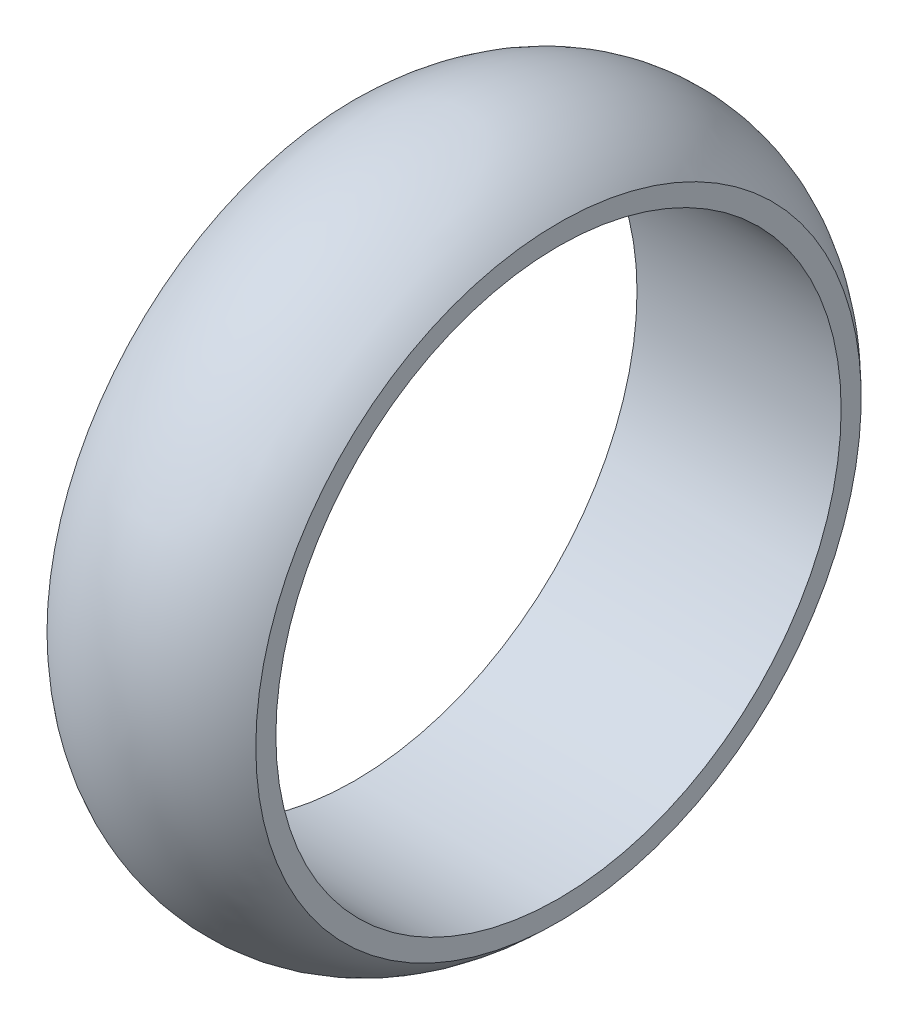
ISO-10303-21;
HEADER;
FILE_DESCRIPTION(('STEP AP214'),'2;1');
FILE_NAME('part.step','',(''),(''),'','','');
FILE_SCHEMA(('AUTOMOTIVE_DESIGN { 1 0 10303 214 1 1 1 1 }'));
ENDSEC;
DATA;
#1=APPLICATION_CONTEXT('core data for automotive mechanical design processes');
#2=APPLICATION_PROTOCOL_DEFINITION('international standard','automotive_design',2000,#1);
#3=PRODUCT_CONTEXT('',#1,'mechanical');
#4=PRODUCT('Part','Part','',(#3));
#5=PRODUCT_RELATED_PRODUCT_CATEGORY('part','',(#4));
#6=PRODUCT_DEFINITION_FORMATION('','',#4);
#7=PRODUCT_DEFINITION_CONTEXT('part definition',#1,'design');
#8=PRODUCT_DEFINITION('design','',#6,#7);
#9=PRODUCT_DEFINITION_SHAPE('','',#8);
#10=(LENGTH_UNIT() NAMED_UNIT(*) SI_UNIT(.MILLI.,.METRE.));
#11=(NAMED_UNIT(*) PLANE_ANGLE_UNIT() SI_UNIT($,.RADIAN.));
#12=(NAMED_UNIT(*) SI_UNIT($,.STERADIAN.) SOLID_ANGLE_UNIT());
#13=UNCERTAINTY_MEASURE_WITH_UNIT(LENGTH_MEASURE(1.E-05),#10,'distance_accuracy_value','');
#14=(GEOMETRIC_REPRESENTATION_CONTEXT(3) GLOBAL_UNCERTAINTY_ASSIGNED_CONTEXT((#13)) GLOBAL_UNIT_ASSIGNED_CONTEXT((#10,
#11,#12)) REPRESENTATION_CONTEXT('',''));
#15=CARTESIAN_POINT('',(0.,0.,0.));
#16=DIRECTION('',(0.,0.,1.));
#17=DIRECTION('',(1.,0.,0.));
#18=AXIS2_PLACEMENT_3D('',#15,#16,#17);
#19=CARTESIAN_POINT('',(-74.2080903005385,0.,0.));
#20=DIRECTION('',(-1.,0.,0.));
#21=DIRECTION('',(0.,0.,1.));
#22=AXIS2_PLACEMENT_3D('',#19,#20,#21);
#23=CYLINDRICAL_SURFACE('',#22,228.6);
#24=CARTESIAN_POINT('',(82.55,0.,0.));
#25=DIRECTION('',(-1.,0.,0.));
#26=DIRECTION('',(0.,0.,1.));
#27=AXIS2_PLACEMENT_3D('',#24,#25,#26);
#28=CIRCLE('',#27,228.6);
#29=CARTESIAN_POINT('',(82.55,0.,228.6));
#30=VERTEX_POINT('',#29);
#31=EDGE_CURVE('E10',#30,#30,#28,.T.);
#32=ORIENTED_EDGE('',*,*,#31,.F.);
#33=EDGE_LOOP('',(#32));
#34=FACE_BOUND('',#33,.T.);
#35=CARTESIAN_POINT('',(-82.55,0.,0.));
#36=DIRECTION('',(-1.,0.,0.));
#37=DIRECTION('',(0.,0.,1.));
#38=AXIS2_PLACEMENT_3D('',#35,#36,#37);
#39=CIRCLE('',#38,228.6);
#40=CARTESIAN_POINT('',(-82.55,0.,228.6));
#41=VERTEX_POINT('',#40);
#42=EDGE_CURVE('E45',#41,#41,#39,.T.);
#43=ORIENTED_EDGE('',*,*,#42,.T.);
#44=EDGE_LOOP('',(#43));
#45=FACE_BOUND('',#44,.T.);
#46=ADVANCED_FACE('F31',(#34,#45),#23,.F.);
#47=CARTESIAN_POINT('',(82.55,228.6,0.));
#48=DIRECTION('',(-1.,0.,0.));
#49=DIRECTION('',(0.,0.,1.));
#50=AXIS2_PLACEMENT_3D('',#47,#48,#49);
#51=PLANE('',#50);
#52=CARTESIAN_POINT('',(82.55,0.,0.));
#53=DIRECTION('',(-1.,0.,0.));
#54=DIRECTION('',(0.,0.,1.));
#55=AXIS2_PLACEMENT_3D('',#52,#53,#54);
#56=CIRCLE('',#55,244.829127657834);
#57=CARTESIAN_POINT('',(82.55,0.,244.829127657834));
#58=VERTEX_POINT('',#57);
#59=EDGE_CURVE('E37',#58,#58,#56,.T.);
#60=ORIENTED_EDGE('',*,*,#59,.F.);
#61=EDGE_LOOP('',(#60));
#62=FACE_BOUND('',#61,.T.);
#63=ORIENTED_EDGE('',*,*,#31,.T.);
#64=EDGE_LOOP('',(#63));
#65=FACE_BOUND('',#64,.T.);
#66=ADVANCED_FACE('F60',(#62,#65),#51,.F.);
#67=CARTESIAN_POINT('',(-1.88445336868731,0.,0.));
#68=DIRECTION('',(-1.,0.,0.));
#69=DIRECTION('',(0.,0.,1.));
#70=AXIS2_PLACEMENT_3D('',#67,#68,#69);
#71=TOROIDAL_SURFACE('',#70,164.207593839162,116.743345124869);
#72=CARTESIAN_POINT('',(-82.55,0.,0.));
#73=DIRECTION('',(-1.,0.,0.));
#74=DIRECTION('',(0.,0.,1.));
#75=AXIS2_PLACEMENT_3D('',#72,#73,#74);
#76=CIRCLE('',#75,248.6);
#77=CARTESIAN_POINT('',(-82.55,0.,248.6));
#78=VERTEX_POINT('',#77);
#79=EDGE_CURVE('E41',#78,#78,#76,.T.);
#80=ORIENTED_EDGE('',*,*,#79,.F.);
#81=EDGE_LOOP('',(#80));
#82=FACE_BOUND('',#81,.T.);
#83=ORIENTED_EDGE('',*,*,#59,.T.);
#84=EDGE_LOOP('',(#83));
#85=FACE_BOUND('',#84,.T.);
#86=ADVANCED_FACE('F55',(#82,#85),#71,.T.);
#87=CARTESIAN_POINT('',(-82.55,228.6,0.));
#88=DIRECTION('',(1.,0.,0.));
#89=DIRECTION('',(0.,0.,-1.));
#90=AXIS2_PLACEMENT_3D('',#87,#88,#89);
#91=PLANE('',#90);
#92=ORIENTED_EDGE('',*,*,#42,.F.);
#93=EDGE_LOOP('',(#92));
#94=FACE_BOUND('',#93,.T.);
#95=ORIENTED_EDGE('',*,*,#79,.T.);
#96=EDGE_LOOP('',(#95));
#97=FACE_BOUND('',#96,.T.);
#98=ADVANCED_FACE('F52',(#94,#97),#91,.F.);
#99=CLOSED_SHELL('',(#46,#66,#86,#98));
#100=MANIFOLD_SOLID_BREP('B2',#99);
#101=ADVANCED_BREP_SHAPE_REPRESENTATION('',(#18,#100),#14);
#102=SHAPE_DEFINITION_REPRESENTATION(#9,#101);
ENDSEC;
END-ISO-10303-21;
